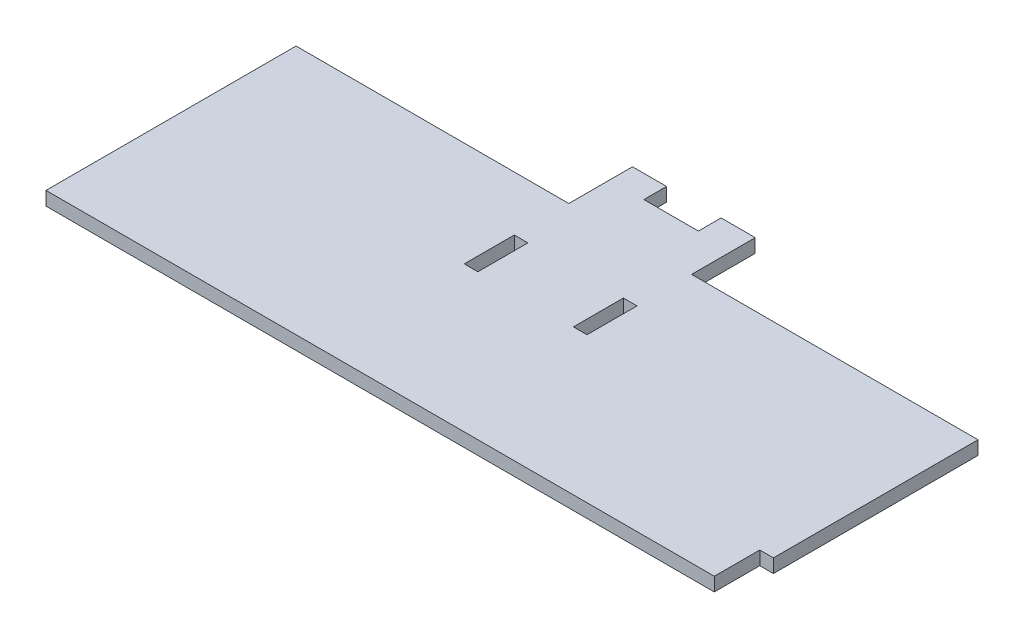
ISO-10303-21;
HEADER;
FILE_DESCRIPTION(('STEP AP214'),'2;1');
FILE_NAME('part.step','',(''),(''),'','','');
FILE_SCHEMA(('AUTOMOTIVE_DESIGN { 1 0 10303 214 1 1 1 1 }'));
ENDSEC;
DATA;
#1=APPLICATION_CONTEXT('core data for automotive mechanical design processes');
#2=APPLICATION_PROTOCOL_DEFINITION('international standard','automotive_design',2000,#1);
#3=PRODUCT_CONTEXT('',#1,'mechanical');
#4=PRODUCT('Part','Part','',(#3));
#5=PRODUCT_RELATED_PRODUCT_CATEGORY('part','',(#4));
#6=PRODUCT_DEFINITION_FORMATION('','',#4);
#7=PRODUCT_DEFINITION_CONTEXT('part definition',#1,'design');
#8=PRODUCT_DEFINITION('design','',#6,#7);
#9=PRODUCT_DEFINITION_SHAPE('','',#8);
#10=(LENGTH_UNIT() NAMED_UNIT(*) SI_UNIT(.MILLI.,.METRE.));
#11=(NAMED_UNIT(*) PLANE_ANGLE_UNIT() SI_UNIT($,.RADIAN.));
#12=(NAMED_UNIT(*) SI_UNIT($,.STERADIAN.) SOLID_ANGLE_UNIT());
#13=UNCERTAINTY_MEASURE_WITH_UNIT(LENGTH_MEASURE(1.E-05),#10,'distance_accuracy_value','');
#14=(GEOMETRIC_REPRESENTATION_CONTEXT(3) GLOBAL_UNCERTAINTY_ASSIGNED_CONTEXT((#13)) GLOBAL_UNIT_ASSIGNED_CONTEXT((#10,
#11,#12)) REPRESENTATION_CONTEXT('',''));
#15=CARTESIAN_POINT('',(0.,0.,0.));
#16=DIRECTION('',(0.,0.,1.));
#17=DIRECTION('',(1.,0.,0.));
#18=AXIS2_PLACEMENT_3D('',#15,#16,#17);
#19=CARTESIAN_POINT('',(0.,-30.4138126514911,-75.3115837217811));
#20=DIRECTION('',(0.,0.,1.));
#21=DIRECTION('',(1.,0.,0.));
#22=AXIS2_PLACEMENT_3D('',#19,#20,#21);
#23=PLANE('',#22);
#24=DIRECTION('',(1.,0.,0.));
#25=VECTOR('',#24,1.);
#26=CARTESIAN_POINT('',(0.,3.,-75.3115837217811));
#27=LINE('',#26,#25);
#28=CARTESIAN_POINT('',(-47.2297166911198,3.,-75.3115837217811));
#29=VERTEX_POINT('',#28);
#30=CARTESIAN_POINT('',(-39.7297166911199,3.,-75.3115837217811));
#31=VERTEX_POINT('',#30);
#32=EDGE_CURVE('E220',#29,#31,#27,.T.);
#33=ORIENTED_EDGE('',*,*,#32,.T.);
#34=DIRECTION('',(0.,-1.,0.));
#35=VECTOR('',#34,1.);
#36=CARTESIAN_POINT('',(-39.7297166911199,-30.4138126514911,-75.3115837217811));
#37=LINE('',#36,#35);
#38=CARTESIAN_POINT('',(-39.7297166911199,0.,-75.3115837217811));
#39=VERTEX_POINT('',#38);
#40=EDGE_CURVE('E11',#31,#39,#37,.T.);
#41=ORIENTED_EDGE('',*,*,#40,.T.);
#42=DIRECTION('',(-1.,0.,0.));
#43=VECTOR('',#42,1.);
#44=CARTESIAN_POINT('',(0.,0.,-75.3115837217811));
#45=LINE('',#44,#43);
#46=CARTESIAN_POINT('',(-47.2297166911198,0.,-75.3115837217811));
#47=VERTEX_POINT('',#46);
#48=EDGE_CURVE('E219',#39,#47,#45,.T.);
#49=ORIENTED_EDGE('',*,*,#48,.T.);
#50=DIRECTION('',(0.,1.,0.));
#51=VECTOR('',#50,1.);
#52=CARTESIAN_POINT('',(-47.2297166911198,-30.4138126514911,-75.3115837217811));
#53=LINE('',#52,#51);
#54=EDGE_CURVE('E224',#47,#29,#53,.T.);
#55=ORIENTED_EDGE('',*,*,#54,.T.);
#56=EDGE_LOOP('',(#33,#41,#49,#55));
#57=FACE_BOUND('',#56,.T.);
#58=ADVANCED_FACE('F33',(#57),#23,.F.);
#59=CARTESIAN_POINT('',(0.,3.,-61.3115837217811));
#60=DIRECTION('',(0.,0.,-1.));
#61=DIRECTION('',(-1.,0.,0.));
#62=AXIS2_PLACEMENT_3D('',#59,#60,#61);
#63=PLANE('',#62);
#64=DIRECTION('',(1.,0.,0.));
#65=VECTOR('',#64,1.);
#66=CARTESIAN_POINT('',(0.,0.,-61.3115837217811));
#67=LINE('',#66,#65);
#68=CARTESIAN_POINT('',(-20.2297166911198,0.,-61.3115837217811));
#69=VERTEX_POINT('',#68);
#70=CARTESIAN_POINT('',(42.7702833088802,0.,-61.3115837217811));
#71=VERTEX_POINT('',#70);
#72=EDGE_CURVE('E268',#69,#71,#67,.T.);
#73=ORIENTED_EDGE('',*,*,#72,.F.);
#74=DIRECTION('',(0.,1.,0.));
#75=VECTOR('',#74,1.);
#76=CARTESIAN_POINT('',(-20.2297166911198,-30.4138126514911,-61.3115837217811));
#77=LINE('',#76,#75);
#78=CARTESIAN_POINT('',(-20.2297166911198,3.,-61.3115837217811));
#79=VERTEX_POINT('',#78);
#80=EDGE_CURVE('E229',#69,#79,#77,.T.);
#81=ORIENTED_EDGE('',*,*,#80,.T.);
#82=DIRECTION('',(1.,0.,0.));
#83=VECTOR('',#82,1.);
#84=CARTESIAN_POINT('',(0.,3.,-61.3115837217811));
#85=LINE('',#84,#83);
#86=CARTESIAN_POINT('',(42.7702833088802,3.,-61.3115837217811));
#87=VERTEX_POINT('',#86);
#88=EDGE_CURVE('E330',#79,#87,#85,.T.);
#89=ORIENTED_EDGE('',*,*,#88,.T.);
#90=DIRECTION('',(0.,-1.,0.));
#91=VECTOR('',#90,1.);
#92=CARTESIAN_POINT('',(42.7702833088802,3.,-61.3115837217811));
#93=LINE('',#92,#91);
#94=EDGE_CURVE('E250',#87,#71,#93,.T.);
#95=ORIENTED_EDGE('',*,*,#94,.T.);
#96=EDGE_LOOP('',(#73,#81,#89,#95));
#97=FACE_BOUND('',#96,.T.);
#98=ADVANCED_FACE('F354',(#97),#63,.T.);
#99=CARTESIAN_POINT('',(0.,3.,0.));
#100=DIRECTION('',(0.,1.,0.));
#101=DIRECTION('',(0.,0.,1.));
#102=AXIS2_PLACEMENT_3D('',#99,#100,#101);
#103=PLANE('',#102);
#104=DIRECTION('',(0.,0.,1.));
#105=VECTOR('',#104,1.);
#106=CARTESIAN_POINT('',(-39.7297166911199,3.,-80.3115837217811));
#107=LINE('',#106,#105);
#108=CARTESIAN_POINT('',(-39.7297166911199,3.,-70.3115837217811));
#109=VERTEX_POINT('',#108);
#110=EDGE_CURVE('E184',#31,#109,#107,.T.);
#111=ORIENTED_EDGE('',*,*,#110,.F.);
#112=ORIENTED_EDGE('',*,*,#32,.F.);
#113=DIRECTION('',(0.,0.,-1.));
#114=VECTOR('',#113,1.);
#115=CARTESIAN_POINT('',(-47.2297166911198,3.,0.));
#116=LINE('',#115,#114);
#117=CARTESIAN_POINT('',(-47.2297166911198,3.,-61.3115837217811));
#118=VERTEX_POINT('',#117);
#119=EDGE_CURVE('E213',#118,#29,#116,.T.);
#120=ORIENTED_EDGE('',*,*,#119,.F.);
#121=CARTESIAN_POINT('',(-107.22971669112,3.,-61.3115837217811));
#122=VERTEX_POINT('',#121);
#123=EDGE_CURVE('E324',#122,#118,#85,.T.);
#124=ORIENTED_EDGE('',*,*,#123,.F.);
#125=DIRECTION('',(0.,0.,1.));
#126=VECTOR('',#125,1.);
#127=CARTESIAN_POINT('',(-107.22971669112,3.,0.));
#128=LINE('',#127,#126);
#129=CARTESIAN_POINT('',(-107.22971669112,3.,-6.31158372178109));
#130=VERTEX_POINT('',#129);
#131=EDGE_CURVE('E320',#122,#130,#128,.T.);
#132=ORIENTED_EDGE('',*,*,#131,.T.);
#133=DIRECTION('',(1.,0.,0.));
#134=VECTOR('',#133,1.);
#135=CARTESIAN_POINT('',(0.,3.,-6.31158372178109));
#136=LINE('',#135,#134);
#137=CARTESIAN_POINT('',(39.7702833088801,3.,-6.31158372178109));
#138=VERTEX_POINT('',#137);
#139=EDGE_CURVE('E300',#130,#138,#136,.T.);
#140=ORIENTED_EDGE('',*,*,#139,.T.);
#141=DIRECTION('',(0.,0.,1.));
#142=VECTOR('',#141,1.);
#143=CARTESIAN_POINT('',(39.7702833088801,3.,0.));
#144=LINE('',#143,#142);
#145=CARTESIAN_POINT('',(39.7702833088801,3.,-16.3115837217811));
#146=VERTEX_POINT('',#145);
#147=EDGE_CURVE('E316',#146,#138,#144,.T.);
#148=ORIENTED_EDGE('',*,*,#147,.F.);
#149=DIRECTION('',(-1.,0.,0.));
#150=VECTOR('',#149,1.);
#151=CARTESIAN_POINT('',(0.,3.,-16.3115837217811));
#152=LINE('',#151,#150);
#153=CARTESIAN_POINT('',(42.7702833088802,3.,-16.3115837217811));
#154=VERTEX_POINT('',#153);
#155=EDGE_CURVE('E290',#154,#146,#152,.T.);
#156=ORIENTED_EDGE('',*,*,#155,.F.);
#157=DIRECTION('',(0.,0.,1.));
#158=VECTOR('',#157,1.);
#159=CARTESIAN_POINT('',(42.7702833088802,3.,0.));
#160=LINE('',#159,#158);
#161=EDGE_CURVE('E286',#87,#154,#160,.T.);
#162=ORIENTED_EDGE('',*,*,#161,.F.);
#163=ORIENTED_EDGE('',*,*,#88,.F.);
#164=DIRECTION('',(0.,0.,-1.));
#165=VECTOR('',#164,1.);
#166=CARTESIAN_POINT('',(-20.2297166911198,3.,0.));
#167=LINE('',#166,#165);
#168=CARTESIAN_POINT('',(-20.2297166911198,3.,-75.3115837217811));
#169=VERTEX_POINT('',#168);
#170=EDGE_CURVE('E56',#79,#169,#167,.T.);
#171=ORIENTED_EDGE('',*,*,#170,.T.);
#172=CARTESIAN_POINT('',(-27.7297166911199,3.,-75.3115837217811));
#173=VERTEX_POINT('',#172);
#174=EDGE_CURVE('E223',#173,#169,#27,.T.);
#175=ORIENTED_EDGE('',*,*,#174,.F.);
#176=DIRECTION('',(0.,0.,-1.));
#177=VECTOR('',#176,1.);
#178=CARTESIAN_POINT('',(-27.7297166911199,3.,-80.3115837217811));
#179=LINE('',#178,#177);
#180=CARTESIAN_POINT('',(-27.7297166911199,3.,-70.3115837217811));
#181=VERTEX_POINT('',#180);
#182=EDGE_CURVE('E48',#181,#173,#179,.T.);
#183=ORIENTED_EDGE('',*,*,#182,.F.);
#184=DIRECTION('',(1.,0.,0.));
#185=VECTOR('',#184,1.);
#186=CARTESIAN_POINT('',(-27.7297166911199,3.,-70.3115837217811));
#187=LINE('',#186,#185);
#188=EDGE_CURVE('E193',#109,#181,#187,.T.);
#189=ORIENTED_EDGE('',*,*,#188,.F.);
#190=EDGE_LOOP('',(#111,#112,#120,#124,#132,#140,#148,#156,#162,#163,#171,#175,#183,#189));
#191=FACE_BOUND('',#190,.T.);
#192=DIRECTION('',(0.,0.,-1.));
#193=VECTOR('',#192,1.);
#194=CARTESIAN_POINT('',(-44.2297166911198,3.,0.));
#195=LINE('',#194,#193);
#196=CARTESIAN_POINT('',(-44.2297166911198,3.,-38.3115837217811));
#197=VERTEX_POINT('',#196);
#198=CARTESIAN_POINT('',(-44.2297166911198,3.,-49.3115837217811));
#199=VERTEX_POINT('',#198);
#200=EDGE_CURVE('E595',#197,#199,#195,.T.);
#201=ORIENTED_EDGE('',*,*,#200,.F.);
#202=DIRECTION('',(-1.,0.,0.));
#203=VECTOR('',#202,1.);
#204=CARTESIAN_POINT('',(0.,3.,-38.3115837217811));
#205=LINE('',#204,#203);
#206=CARTESIAN_POINT('',(-47.2297166911198,3.,-38.3115837217811));
#207=VERTEX_POINT('',#206);
#208=EDGE_CURVE('E626',#197,#207,#205,.T.);
#209=ORIENTED_EDGE('',*,*,#208,.T.);
#210=DIRECTION('',(0.,0.,1.));
#211=VECTOR('',#210,1.);
#212=CARTESIAN_POINT('',(-47.2297166911198,3.,0.));
#213=LINE('',#212,#211);
#214=CARTESIAN_POINT('',(-47.2297166911198,3.,-49.3115837217811));
#215=VERTEX_POINT('',#214);
#216=EDGE_CURVE('E639',#215,#207,#213,.T.);
#217=ORIENTED_EDGE('',*,*,#216,.F.);
#218=DIRECTION('',(-1.,0.,0.));
#219=VECTOR('',#218,1.);
#220=CARTESIAN_POINT('',(0.,3.,-49.3115837217811));
#221=LINE('',#220,#219);
#222=EDGE_CURVE('E636',#199,#215,#221,.T.);
#223=ORIENTED_EDGE('',*,*,#222,.F.);
#224=EDGE_LOOP('',(#201,#209,#217,#223));
#225=FACE_BOUND('',#224,.T.);
#226=DIRECTION('',(-1.,0.,0.));
#227=VECTOR('',#226,1.);
#228=CARTESIAN_POINT('',(-20.2297166911198,3.,-38.311583721781));
#229=LINE('',#228,#227);
#230=CARTESIAN_POINT('',(-20.2297166911198,3.,-38.311583721781));
#231=VERTEX_POINT('',#230);
#232=CARTESIAN_POINT('',(-23.2297166911198,3.,-38.311583721781));
#233=VERTEX_POINT('',#232);
#234=EDGE_CURVE('E587',#231,#233,#229,.T.);
#235=ORIENTED_EDGE('',*,*,#234,.T.);
#236=DIRECTION('',(0.,0.,1.));
#237=VECTOR('',#236,1.);
#238=CARTESIAN_POINT('',(-23.2297166911198,3.,-48.311583721781));
#239=LINE('',#238,#237);
#240=CARTESIAN_POINT('',(-23.2297166911198,3.,-49.311583721781));
#241=VERTEX_POINT('',#240);
#242=EDGE_CURVE('E596',#241,#233,#239,.T.);
#243=ORIENTED_EDGE('',*,*,#242,.F.);
#244=DIRECTION('',(-1.,0.,0.));
#245=VECTOR('',#244,1.);
#246=CARTESIAN_POINT('',(0.,3.,-49.311583721781));
#247=LINE('',#246,#245);
#248=CARTESIAN_POINT('',(-20.2297166911198,3.,-49.311583721781));
#249=VERTEX_POINT('',#248);
#250=EDGE_CURVE('E601',#249,#241,#247,.T.);
#251=ORIENTED_EDGE('',*,*,#250,.F.);
#252=DIRECTION('',(0.,0.,-1.));
#253=VECTOR('',#252,1.);
#254=CARTESIAN_POINT('',(-20.2297166911198,3.,-38.311583721781));
#255=LINE('',#254,#253);
#256=EDGE_CURVE('E599',#231,#249,#255,.T.);
#257=ORIENTED_EDGE('',*,*,#256,.F.);
#258=EDGE_LOOP('',(#235,#243,#251,#257));
#259=FACE_BOUND('',#258,.T.);
#260=ADVANCED_FACE('F203',(#191,#225,#259),#103,.T.);
#261=CARTESIAN_POINT('',(0.,0.,0.));
#262=DIRECTION('',(0.,1.,0.));
#263=DIRECTION('',(0.,0.,1.));
#264=AXIS2_PLACEMENT_3D('',#261,#262,#263);
#265=PLANE('',#264);
#266=ORIENTED_EDGE('',*,*,#48,.F.);
#267=DIRECTION('',(0.,0.,-1.));
#268=VECTOR('',#267,1.);
#269=CARTESIAN_POINT('',(-39.7297166911199,0.,-80.3115837217811));
#270=LINE('',#269,#268);
#271=CARTESIAN_POINT('',(-39.7297166911199,0.,-70.3115837217811));
#272=VERTEX_POINT('',#271);
#273=EDGE_CURVE('E214',#272,#39,#270,.T.);
#274=ORIENTED_EDGE('',*,*,#273,.F.);
#275=DIRECTION('',(-1.,0.,0.));
#276=VECTOR('',#275,1.);
#277=CARTESIAN_POINT('',(-27.7297166911199,0.,-70.3115837217811));
#278=LINE('',#277,#276);
#279=CARTESIAN_POINT('',(-27.7297166911199,0.,-70.3115837217811));
#280=VERTEX_POINT('',#279);
#281=EDGE_CURVE('E200',#280,#272,#278,.T.);
#282=ORIENTED_EDGE('',*,*,#281,.F.);
#283=DIRECTION('',(0.,0.,1.));
#284=VECTOR('',#283,1.);
#285=CARTESIAN_POINT('',(-27.7297166911199,0.,-80.3115837217811));
#286=LINE('',#285,#284);
#287=CARTESIAN_POINT('',(-27.7297166911199,0.,-75.3115837217811));
#288=VERTEX_POINT('',#287);
#289=EDGE_CURVE('E210',#288,#280,#286,.T.);
#290=ORIENTED_EDGE('',*,*,#289,.F.);
#291=CARTESIAN_POINT('',(-20.2297166911198,0.,-75.3115837217811));
#292=VERTEX_POINT('',#291);
#293=EDGE_CURVE('E215',#292,#288,#45,.T.);
#294=ORIENTED_EDGE('',*,*,#293,.F.);
#295=DIRECTION('',(0.,0.,1.));
#296=VECTOR('',#295,1.);
#297=CARTESIAN_POINT('',(-20.2297166911198,0.,0.));
#298=LINE('',#297,#296);
#299=EDGE_CURVE('E226',#292,#69,#298,.T.);
#300=ORIENTED_EDGE('',*,*,#299,.T.);
#301=ORIENTED_EDGE('',*,*,#72,.T.);
#302=DIRECTION('',(0.,0.,1.));
#303=VECTOR('',#302,1.);
#304=CARTESIAN_POINT('',(42.7702833088802,0.,0.));
#305=LINE('',#304,#303);
#306=CARTESIAN_POINT('',(42.7702833088802,0.,-16.3115837217811));
#307=VERTEX_POINT('',#306);
#308=EDGE_CURVE('E273',#71,#307,#305,.T.);
#309=ORIENTED_EDGE('',*,*,#308,.T.);
#310=DIRECTION('',(-1.,0.,0.));
#311=VECTOR('',#310,1.);
#312=CARTESIAN_POINT('',(0.,0.,-16.3115837217811));
#313=LINE('',#312,#311);
#314=CARTESIAN_POINT('',(39.7702833088801,0.,-16.3115837217811));
#315=VERTEX_POINT('',#314);
#316=EDGE_CURVE('E283',#307,#315,#313,.T.);
#317=ORIENTED_EDGE('',*,*,#316,.T.);
#318=DIRECTION('',(0.,0.,1.));
#319=VECTOR('',#318,1.);
#320=CARTESIAN_POINT('',(39.7702833088801,0.,0.));
#321=LINE('',#320,#319);
#322=CARTESIAN_POINT('',(39.7702833088801,0.,-6.31158372178109));
#323=VERTEX_POINT('',#322);
#324=EDGE_CURVE('E280',#315,#323,#321,.T.);
#325=ORIENTED_EDGE('',*,*,#324,.T.);
#326=DIRECTION('',(1.,0.,0.));
#327=VECTOR('',#326,1.);
#328=CARTESIAN_POINT('',(0.,0.,-6.31158372178109));
#329=LINE('',#328,#327);
#330=CARTESIAN_POINT('',(-107.22971669112,0.,-6.31158372178109));
#331=VERTEX_POINT('',#330);
#332=EDGE_CURVE('E277',#331,#323,#329,.T.);
#333=ORIENTED_EDGE('',*,*,#332,.F.);
#334=DIRECTION('',(0.,0.,1.));
#335=VECTOR('',#334,1.);
#336=CARTESIAN_POINT('',(-107.22971669112,0.,0.));
#337=LINE('',#336,#335);
#338=CARTESIAN_POINT('',(-107.22971669112,0.,-61.3115837217811));
#339=VERTEX_POINT('',#338);
#340=EDGE_CURVE('E267',#339,#331,#337,.T.);
#341=ORIENTED_EDGE('',*,*,#340,.F.);
#342=CARTESIAN_POINT('',(-47.2297166911198,0.,-61.3115837217811));
#343=VERTEX_POINT('',#342);
#344=EDGE_CURVE('E263',#339,#343,#67,.T.);
#345=ORIENTED_EDGE('',*,*,#344,.T.);
#346=DIRECTION('',(0.,0.,1.));
#347=VECTOR('',#346,1.);
#348=CARTESIAN_POINT('',(-47.2297166911198,0.,0.));
#349=LINE('',#348,#347);
#350=EDGE_CURVE('E218',#47,#343,#349,.T.);
#351=ORIENTED_EDGE('',*,*,#350,.F.);
#352=EDGE_LOOP('',(#266,#274,#282,#290,#294,#300,#301,#309,#317,#325,#333,#341,#345,#351));
#353=FACE_BOUND('',#352,.T.);
#354=DIRECTION('',(-1.,0.,0.));
#355=VECTOR('',#354,1.);
#356=CARTESIAN_POINT('',(0.,0.,-38.3115837217811));
#357=LINE('',#356,#355);
#358=CARTESIAN_POINT('',(-44.2297166911198,0.,-38.3115837217811));
#359=VERTEX_POINT('',#358);
#360=CARTESIAN_POINT('',(-47.2297166911198,0.,-38.3115837217811));
#361=VERTEX_POINT('',#360);
#362=EDGE_CURVE('E632',#359,#361,#357,.T.);
#363=ORIENTED_EDGE('',*,*,#362,.F.);
#364=DIRECTION('',(0.,0.,-1.));
#365=VECTOR('',#364,1.);
#366=CARTESIAN_POINT('',(-44.2297166911198,0.,0.));
#367=LINE('',#366,#365);
#368=CARTESIAN_POINT('',(-44.2297166911198,0.,-49.3115837217811));
#369=VERTEX_POINT('',#368);
#370=EDGE_CURVE('E622',#359,#369,#367,.T.);
#371=ORIENTED_EDGE('',*,*,#370,.T.);
#372=DIRECTION('',(-1.,0.,0.));
#373=VECTOR('',#372,1.);
#374=CARTESIAN_POINT('',(0.,0.,-49.3115837217811));
#375=LINE('',#374,#373);
#376=CARTESIAN_POINT('',(-47.2297166911198,0.,-49.3115837217811));
#377=VERTEX_POINT('',#376);
#378=EDGE_CURVE('E625',#369,#377,#375,.T.);
#379=ORIENTED_EDGE('',*,*,#378,.T.);
#380=DIRECTION('',(0.,0.,1.));
#381=VECTOR('',#380,1.);
#382=CARTESIAN_POINT('',(-47.2297166911198,0.,0.));
#383=LINE('',#382,#381);
#384=EDGE_CURVE('E629',#377,#361,#383,.T.);
#385=ORIENTED_EDGE('',*,*,#384,.T.);
#386=EDGE_LOOP('',(#363,#371,#379,#385));
#387=FACE_BOUND('',#386,.T.);
#388=DIRECTION('',(0.,0.,1.));
#389=VECTOR('',#388,1.);
#390=CARTESIAN_POINT('',(-23.2297166911198,0.,-48.311583721781));
#391=LINE('',#390,#389);
#392=CARTESIAN_POINT('',(-23.2297166911198,0.,-49.311583721781));
#393=VERTEX_POINT('',#392);
#394=CARTESIAN_POINT('',(-23.2297166911198,0.,-38.311583721781));
#395=VERTEX_POINT('',#394);
#396=EDGE_CURVE('E606',#393,#395,#391,.T.);
#397=ORIENTED_EDGE('',*,*,#396,.T.);
#398=DIRECTION('',(-1.,0.,0.));
#399=VECTOR('',#398,1.);
#400=CARTESIAN_POINT('',(-20.2297166911198,0.,-38.311583721781));
#401=LINE('',#400,#399);
#402=CARTESIAN_POINT('',(-20.2297166911198,0.,-38.311583721781));
#403=VERTEX_POINT('',#402);
#404=EDGE_CURVE('E603',#403,#395,#401,.T.);
#405=ORIENTED_EDGE('',*,*,#404,.F.);
#406=DIRECTION('',(0.,0.,-1.));
#407=VECTOR('',#406,1.);
#408=CARTESIAN_POINT('',(-20.2297166911198,0.,-38.311583721781));
#409=LINE('',#408,#407);
#410=CARTESIAN_POINT('',(-20.2297166911198,0.,-49.311583721781));
#411=VERTEX_POINT('',#410);
#412=EDGE_CURVE('E610',#403,#411,#409,.T.);
#413=ORIENTED_EDGE('',*,*,#412,.T.);
#414=DIRECTION('',(-1.,0.,0.));
#415=VECTOR('',#414,1.);
#416=CARTESIAN_POINT('',(0.,0.,-49.311583721781));
#417=LINE('',#416,#415);
#418=EDGE_CURVE('E617',#411,#393,#417,.T.);
#419=ORIENTED_EDGE('',*,*,#418,.T.);
#420=EDGE_LOOP('',(#397,#405,#413,#419));
#421=FACE_BOUND('',#420,.T.);
#422=ADVANCED_FACE('F306',(#353,#387,#421),#265,.F.);
#423=CARTESIAN_POINT('',(42.7702833088802,3.,0.));
#424=DIRECTION('',(1.,0.,0.));
#425=DIRECTION('',(0.,0.,-1.));
#426=AXIS2_PLACEMENT_3D('',#423,#424,#425);
#427=PLANE('',#426);
#428=ORIENTED_EDGE('',*,*,#308,.F.);
#429=ORIENTED_EDGE('',*,*,#94,.F.);
#430=ORIENTED_EDGE('',*,*,#161,.T.);
#431=DIRECTION('',(0.,-1.,0.));
#432=VECTOR('',#431,1.);
#433=CARTESIAN_POINT('',(42.7702833088802,3.,-16.3115837217811));
#434=LINE('',#433,#432);
#435=EDGE_CURVE('E287',#154,#307,#434,.T.);
#436=ORIENTED_EDGE('',*,*,#435,.T.);
#437=EDGE_LOOP('',(#428,#429,#430,#436));
#438=FACE_BOUND('',#437,.T.);
#439=ADVANCED_FACE('F35',(#438),#427,.T.);
#440=DIRECTION('',(0.,1.,0.));
#441=VECTOR('',#440,1.);
#442=CARTESIAN_POINT('',(-47.2297166911198,-30.4138126514911,-61.3115837217811));
#443=LINE('',#442,#441);
#444=EDGE_CURVE('E222',#343,#118,#443,.T.);
#445=ORIENTED_EDGE('',*,*,#444,.F.);
#446=ORIENTED_EDGE('',*,*,#344,.F.);
#447=DIRECTION('',(0.,-1.,0.));
#448=VECTOR('',#447,1.);
#449=CARTESIAN_POINT('',(-107.22971669112,3.,-61.3115837217811));
#450=LINE('',#449,#448);
#451=EDGE_CURVE('E253',#122,#339,#450,.T.);
#452=ORIENTED_EDGE('',*,*,#451,.F.);
#453=ORIENTED_EDGE('',*,*,#123,.T.);
#454=EDGE_LOOP('',(#445,#446,#452,#453));
#455=FACE_BOUND('',#454,.T.);
#456=ADVANCED_FACE('F361',(#455),#63,.T.);
#457=CARTESIAN_POINT('',(-107.22971669112,3.,0.));
#458=DIRECTION('',(1.,0.,0.));
#459=DIRECTION('',(0.,0.,-1.));
#460=AXIS2_PLACEMENT_3D('',#457,#458,#459);
#461=PLANE('',#460);
#462=ORIENTED_EDGE('',*,*,#340,.T.);
#463=DIRECTION('',(0.,-1.,0.));
#464=VECTOR('',#463,1.);
#465=CARTESIAN_POINT('',(-107.22971669112,3.,-6.31158372178109));
#466=LINE('',#465,#464);
#467=EDGE_CURVE('E259',#130,#331,#466,.T.);
#468=ORIENTED_EDGE('',*,*,#467,.F.);
#469=ORIENTED_EDGE('',*,*,#131,.F.);
#470=ORIENTED_EDGE('',*,*,#451,.T.);
#471=EDGE_LOOP('',(#462,#468,#469,#470));
#472=FACE_BOUND('',#471,.T.);
#473=ADVANCED_FACE('F382',(#472),#461,.F.);
#474=CARTESIAN_POINT('',(0.,3.,-6.31158372178109));
#475=DIRECTION('',(0.,0.,-1.));
#476=DIRECTION('',(-1.,0.,0.));
#477=AXIS2_PLACEMENT_3D('',#474,#475,#476);
#478=PLANE('',#477);
#479=ORIENTED_EDGE('',*,*,#332,.T.);
#480=DIRECTION('',(0.,-1.,0.));
#481=VECTOR('',#480,1.);
#482=CARTESIAN_POINT('',(39.7702833088801,3.,-6.31158372178109));
#483=LINE('',#482,#481);
#484=EDGE_CURVE('E292',#138,#323,#483,.T.);
#485=ORIENTED_EDGE('',*,*,#484,.F.);
#486=ORIENTED_EDGE('',*,*,#139,.F.);
#487=ORIENTED_EDGE('',*,*,#467,.T.);
#488=EDGE_LOOP('',(#479,#485,#486,#487));
#489=FACE_BOUND('',#488,.T.);
#490=ADVANCED_FACE('F298',(#489),#478,.F.);
#491=CARTESIAN_POINT('',(39.7702833088801,3.,0.));
#492=DIRECTION('',(1.,0.,0.));
#493=DIRECTION('',(0.,0.,-1.));
#494=AXIS2_PLACEMENT_3D('',#491,#492,#493);
#495=PLANE('',#494);
#496=ORIENTED_EDGE('',*,*,#324,.F.);
#497=DIRECTION('',(0.,-1.,0.));
#498=VECTOR('',#497,1.);
#499=CARTESIAN_POINT('',(39.7702833088801,3.,-16.3115837217811));
#500=LINE('',#499,#498);
#501=EDGE_CURVE('E289',#146,#315,#500,.T.);
#502=ORIENTED_EDGE('',*,*,#501,.F.);
#503=ORIENTED_EDGE('',*,*,#147,.T.);
#504=ORIENTED_EDGE('',*,*,#484,.T.);
#505=EDGE_LOOP('',(#496,#502,#503,#504));
#506=FACE_BOUND('',#505,.T.);
#507=ADVANCED_FACE('F313',(#506),#495,.T.);
#508=CARTESIAN_POINT('',(0.,3.,-16.3115837217811));
#509=DIRECTION('',(0.,0.,1.));
#510=DIRECTION('',(1.,0.,0.));
#511=AXIS2_PLACEMENT_3D('',#508,#509,#510);
#512=PLANE('',#511);
#513=ORIENTED_EDGE('',*,*,#316,.F.);
#514=ORIENTED_EDGE('',*,*,#435,.F.);
#515=ORIENTED_EDGE('',*,*,#155,.T.);
#516=ORIENTED_EDGE('',*,*,#501,.T.);
#517=EDGE_LOOP('',(#513,#514,#515,#516));
#518=FACE_BOUND('',#517,.T.);
#519=ADVANCED_FACE('F340',(#518),#512,.T.);
#520=CARTESIAN_POINT('',(-44.2297166911198,0.,0.));
#521=DIRECTION('',(1.,0.,0.));
#522=DIRECTION('',(0.,0.,-1.));
#523=AXIS2_PLACEMENT_3D('',#520,#521,#522);
#524=PLANE('',#523);
#525=ORIENTED_EDGE('',*,*,#200,.T.);
#526=DIRECTION('',(0.,1.,0.));
#527=VECTOR('',#526,1.);
#528=CARTESIAN_POINT('',(-44.2297166911198,0.,-49.3115837217811));
#529=LINE('',#528,#527);
#530=EDGE_CURVE('E634',#369,#199,#529,.T.);
#531=ORIENTED_EDGE('',*,*,#530,.F.);
#532=ORIENTED_EDGE('',*,*,#370,.F.);
#533=DIRECTION('',(0.,1.,0.));
#534=VECTOR('',#533,1.);
#535=CARTESIAN_POINT('',(-44.2297166911198,0.,-38.3115837217811));
#536=LINE('',#535,#534);
#537=EDGE_CURVE('E644',#359,#197,#536,.T.);
#538=ORIENTED_EDGE('',*,*,#537,.T.);
#539=EDGE_LOOP('',(#525,#531,#532,#538));
#540=FACE_BOUND('',#539,.T.);
#541=ADVANCED_FACE('F342',(#540),#524,.F.);
#542=CARTESIAN_POINT('',(0.,0.,-38.3115837217811));
#543=DIRECTION('',(0.,0.,-1.));
#544=DIRECTION('',(-1.,0.,0.));
#545=AXIS2_PLACEMENT_3D('',#542,#543,#544);
#546=PLANE('',#545);
#547=ORIENTED_EDGE('',*,*,#208,.F.);
#548=ORIENTED_EDGE('',*,*,#537,.F.);
#549=ORIENTED_EDGE('',*,*,#362,.T.);
#550=DIRECTION('',(0.,1.,0.));
#551=VECTOR('',#550,1.);
#552=CARTESIAN_POINT('',(-47.2297166911198,0.,-38.3115837217811));
#553=LINE('',#552,#551);
#554=EDGE_CURVE('E646',#361,#207,#553,.T.);
#555=ORIENTED_EDGE('',*,*,#554,.T.);
#556=EDGE_LOOP('',(#547,#548,#549,#555));
#557=FACE_BOUND('',#556,.T.);
#558=ADVANCED_FACE('F348',(#557),#546,.T.);
#559=CARTESIAN_POINT('',(-47.2297166911198,0.,0.));
#560=DIRECTION('',(-1.,0.,0.));
#561=DIRECTION('',(0.,0.,1.));
#562=AXIS2_PLACEMENT_3D('',#559,#560,#561);
#563=PLANE('',#562);
#564=ORIENTED_EDGE('',*,*,#216,.T.);
#565=ORIENTED_EDGE('',*,*,#554,.F.);
#566=ORIENTED_EDGE('',*,*,#384,.F.);
#567=DIRECTION('',(0.,1.,0.));
#568=VECTOR('',#567,1.);
#569=CARTESIAN_POINT('',(-47.2297166911198,0.,-49.3115837217811));
#570=LINE('',#569,#568);
#571=EDGE_CURVE('E648',#377,#215,#570,.T.);
#572=ORIENTED_EDGE('',*,*,#571,.T.);
#573=EDGE_LOOP('',(#564,#565,#566,#572));
#574=FACE_BOUND('',#573,.T.);
#575=ADVANCED_FACE('F421',(#574),#563,.F.);
#576=CARTESIAN_POINT('',(0.,0.,-49.3115837217811));
#577=DIRECTION('',(0.,0.,-1.));
#578=DIRECTION('',(-1.,0.,0.));
#579=AXIS2_PLACEMENT_3D('',#576,#577,#578);
#580=PLANE('',#579);
#581=ORIENTED_EDGE('',*,*,#222,.T.);
#582=ORIENTED_EDGE('',*,*,#571,.F.);
#583=ORIENTED_EDGE('',*,*,#378,.F.);
#584=ORIENTED_EDGE('',*,*,#530,.T.);
#585=EDGE_LOOP('',(#581,#582,#583,#584));
#586=FACE_BOUND('',#585,.T.);
#587=ADVANCED_FACE('F432',(#586),#580,.F.);
#588=CARTESIAN_POINT('',(-23.2297166911198,0.,0.));
#589=DIRECTION('',(1.,0.,0.));
#590=DIRECTION('',(0.,0.,-1.));
#591=AXIS2_PLACEMENT_3D('',#588,#589,#590);
#592=PLANE('',#591);
#593=ORIENTED_EDGE('',*,*,#242,.T.);
#594=DIRECTION('',(0.,1.,0.));
#595=VECTOR('',#594,1.);
#596=CARTESIAN_POINT('',(-23.2297166911198,0.,-38.311583721781));
#597=LINE('',#596,#595);
#598=EDGE_CURVE('E592',#395,#233,#597,.T.);
#599=ORIENTED_EDGE('',*,*,#598,.F.);
#600=ORIENTED_EDGE('',*,*,#396,.F.);
#601=DIRECTION('',(0.,1.,0.));
#602=VECTOR('',#601,1.);
#603=CARTESIAN_POINT('',(-23.2297166911198,0.,-49.311583721781));
#604=LINE('',#603,#602);
#605=EDGE_CURVE('E243',#393,#241,#604,.T.);
#606=ORIENTED_EDGE('',*,*,#605,.T.);
#607=EDGE_LOOP('',(#593,#599,#600,#606));
#608=FACE_BOUND('',#607,.T.);
#609=ADVANCED_FACE('F442',(#608),#592,.T.);
#610=CARTESIAN_POINT('',(0.,0.,-49.311583721781));
#611=DIRECTION('',(0.,0.,-1.));
#612=DIRECTION('',(-1.,0.,0.));
#613=AXIS2_PLACEMENT_3D('',#610,#611,#612);
#614=PLANE('',#613);
#615=ORIENTED_EDGE('',*,*,#250,.T.);
#616=ORIENTED_EDGE('',*,*,#605,.F.);
#617=ORIENTED_EDGE('',*,*,#418,.F.);
#618=DIRECTION('',(0.,1.,0.));
#619=VECTOR('',#618,1.);
#620=CARTESIAN_POINT('',(-20.2297166911198,0.,-49.311583721781));
#621=LINE('',#620,#619);
#622=EDGE_CURVE('E615',#411,#249,#621,.T.);
#623=ORIENTED_EDGE('',*,*,#622,.T.);
#624=EDGE_LOOP('',(#615,#616,#617,#623));
#625=FACE_BOUND('',#624,.T.);
#626=ADVANCED_FACE('F453',(#625),#614,.F.);
#627=CARTESIAN_POINT('',(-20.2297166911198,0.,0.));
#628=DIRECTION('',(1.,0.,0.));
#629=DIRECTION('',(0.,0.,-1.));
#630=AXIS2_PLACEMENT_3D('',#627,#628,#629);
#631=PLANE('',#630);
#632=ORIENTED_EDGE('',*,*,#622,.F.);
#633=ORIENTED_EDGE('',*,*,#412,.F.);
#634=DIRECTION('',(0.,1.,0.));
#635=VECTOR('',#634,1.);
#636=CARTESIAN_POINT('',(-20.2297166911198,0.,-38.311583721781));
#637=LINE('',#636,#635);
#638=EDGE_CURVE('E589',#403,#231,#637,.T.);
#639=ORIENTED_EDGE('',*,*,#638,.T.);
#640=ORIENTED_EDGE('',*,*,#256,.T.);
#641=EDGE_LOOP('',(#632,#633,#639,#640));
#642=FACE_BOUND('',#641,.T.);
#643=ADVANCED_FACE('F374',(#642),#631,.F.);
#644=CARTESIAN_POINT('',(-20.2297166911198,0.,-38.311583721781));
#645=DIRECTION('',(0.,0.,-1.));
#646=DIRECTION('',(-1.,0.,0.));
#647=AXIS2_PLACEMENT_3D('',#644,#645,#646);
#648=PLANE('',#647);
#649=ORIENTED_EDGE('',*,*,#234,.F.);
#650=ORIENTED_EDGE('',*,*,#638,.F.);
#651=ORIENTED_EDGE('',*,*,#404,.T.);
#652=ORIENTED_EDGE('',*,*,#598,.T.);
#653=EDGE_LOOP('',(#649,#650,#651,#652));
#654=FACE_BOUND('',#653,.T.);
#655=ADVANCED_FACE('F373',(#654),#648,.T.);
#656=CARTESIAN_POINT('',(-20.2297166911198,-30.4138126514911,0.));
#657=DIRECTION('',(1.,0.,0.));
#658=DIRECTION('',(0.,0.,-1.));
#659=AXIS2_PLACEMENT_3D('',#656,#657,#658);
#660=PLANE('',#659);
#661=ORIENTED_EDGE('',*,*,#299,.F.);
#662=DIRECTION('',(0.,1.,0.));
#663=VECTOR('',#662,1.);
#664=CARTESIAN_POINT('',(-20.2297166911198,-30.4138126514911,-75.3115837217811));
#665=LINE('',#664,#663);
#666=EDGE_CURVE('E227',#292,#169,#665,.T.);
#667=ORIENTED_EDGE('',*,*,#666,.T.);
#668=ORIENTED_EDGE('',*,*,#170,.F.);
#669=ORIENTED_EDGE('',*,*,#80,.F.);
#670=EDGE_LOOP('',(#661,#667,#668,#669));
#671=FACE_BOUND('',#670,.T.);
#672=ADVANCED_FACE('F366',(#671),#660,.T.);
#673=ORIENTED_EDGE('',*,*,#293,.T.);
#674=DIRECTION('',(0.,1.,0.));
#675=VECTOR('',#674,1.);
#676=CARTESIAN_POINT('',(-27.7297166911199,-30.4138126514911,-75.3115837217811));
#677=LINE('',#676,#675);
#678=EDGE_CURVE('E41',#288,#173,#677,.T.);
#679=ORIENTED_EDGE('',*,*,#678,.T.);
#680=ORIENTED_EDGE('',*,*,#174,.T.);
#681=ORIENTED_EDGE('',*,*,#666,.F.);
#682=EDGE_LOOP('',(#673,#679,#680,#681));
#683=FACE_BOUND('',#682,.T.);
#684=ADVANCED_FACE('F357',(#683),#23,.F.);
#685=CARTESIAN_POINT('',(-47.2297166911198,-30.4138126514911,0.));
#686=DIRECTION('',(1.,0.,0.));
#687=DIRECTION('',(0.,0.,-1.));
#688=AXIS2_PLACEMENT_3D('',#685,#686,#687);
#689=PLANE('',#688);
#690=ORIENTED_EDGE('',*,*,#54,.F.);
#691=ORIENTED_EDGE('',*,*,#350,.T.);
#692=ORIENTED_EDGE('',*,*,#444,.T.);
#693=ORIENTED_EDGE('',*,*,#119,.T.);
#694=EDGE_LOOP('',(#690,#691,#692,#693));
#695=FACE_BOUND('',#694,.T.);
#696=ADVANCED_FACE('F365',(#695),#689,.F.);
#697=CARTESIAN_POINT('',(-39.7297166911199,-15.6204993518133,-80.3115837217811));
#698=DIRECTION('',(-1.,0.,0.));
#699=DIRECTION('',(0.,0.,1.));
#700=AXIS2_PLACEMENT_3D('',#697,#698,#699);
#701=PLANE('',#700);
#702=ORIENTED_EDGE('',*,*,#110,.T.);
#703=DIRECTION('',(0.,1.,0.));
#704=VECTOR('',#703,1.);
#705=CARTESIAN_POINT('',(-39.7297166911199,-15.6204993518133,-70.3115837217811));
#706=LINE('',#705,#704);
#707=EDGE_CURVE('E187',#272,#109,#706,.T.);
#708=ORIENTED_EDGE('',*,*,#707,.F.);
#709=ORIENTED_EDGE('',*,*,#273,.T.);
#710=ORIENTED_EDGE('',*,*,#40,.F.);
#711=EDGE_LOOP('',(#702,#708,#709,#710));
#712=FACE_BOUND('',#711,.T.);
#713=ADVANCED_FACE('F186',(#712),#701,.F.);
#714=CARTESIAN_POINT('',(-27.7297166911199,-15.6204993518133,-80.3115837217811));
#715=DIRECTION('',(1.,0.,0.));
#716=DIRECTION('',(0.,0.,-1.));
#717=AXIS2_PLACEMENT_3D('',#714,#715,#716);
#718=PLANE('',#717);
#719=ORIENTED_EDGE('',*,*,#289,.T.);
#720=DIRECTION('',(0.,1.,0.));
#721=VECTOR('',#720,1.);
#722=CARTESIAN_POINT('',(-27.7297166911199,-15.6204993518133,-70.3115837217811));
#723=LINE('',#722,#721);
#724=EDGE_CURVE('E201',#280,#181,#723,.T.);
#725=ORIENTED_EDGE('',*,*,#724,.T.);
#726=ORIENTED_EDGE('',*,*,#182,.T.);
#727=ORIENTED_EDGE('',*,*,#678,.F.);
#728=EDGE_LOOP('',(#719,#725,#726,#727));
#729=FACE_BOUND('',#728,.T.);
#730=ADVANCED_FACE('F540',(#729),#718,.F.);
#731=CARTESIAN_POINT('',(-27.7297166911199,-15.6204993518133,-70.3115837217811));
#732=DIRECTION('',(0.,0.,1.));
#733=DIRECTION('',(1.,0.,0.));
#734=AXIS2_PLACEMENT_3D('',#731,#732,#733);
#735=PLANE('',#734);
#736=ORIENTED_EDGE('',*,*,#281,.T.);
#737=ORIENTED_EDGE('',*,*,#707,.T.);
#738=ORIENTED_EDGE('',*,*,#188,.T.);
#739=ORIENTED_EDGE('',*,*,#724,.F.);
#740=EDGE_LOOP('',(#736,#737,#738,#739));
#741=FACE_BOUND('',#740,.T.);
#742=ADVANCED_FACE('F197',(#741),#735,.F.);
#743=CLOSED_SHELL('',(#58,#98,#260,#422,#439,#456,#473,#490,#507,#519,#541,#558,#575,#587,#609,
#626,#643,#655,#672,#684,#696,#713,#730,#742));
#744=MANIFOLD_SOLID_BREP('B2',#743);
#745=ADVANCED_BREP_SHAPE_REPRESENTATION('',(#18,#744),#14);
#746=SHAPE_DEFINITION_REPRESENTATION(#9,#745);
ENDSEC;
END-ISO-10303-21;
